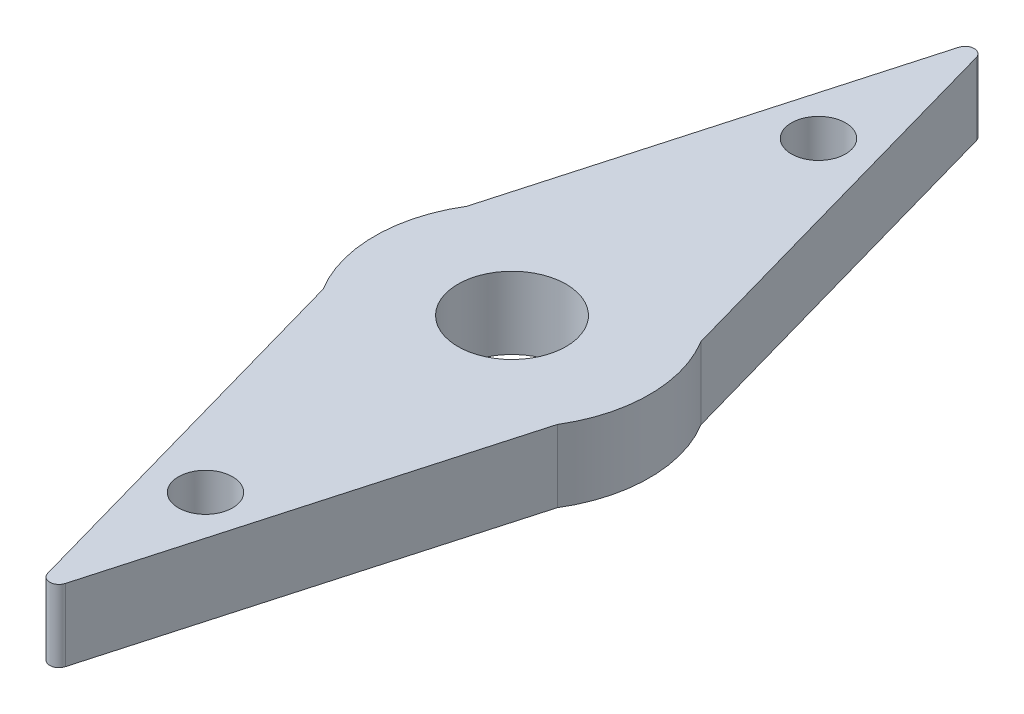
ISO-10303-21;
HEADER;
FILE_DESCRIPTION(('STEP AP214'),'2;1');
FILE_NAME('part.step','',(''),(''),'','','');
FILE_SCHEMA(('AUTOMOTIVE_DESIGN { 1 0 10303 214 1 1 1 1 }'));
ENDSEC;
DATA;
#1=APPLICATION_CONTEXT('core data for automotive mechanical design processes');
#2=APPLICATION_PROTOCOL_DEFINITION('international standard','automotive_design',2000,#1);
#3=PRODUCT_CONTEXT('',#1,'mechanical');
#4=PRODUCT('Part','Part','',(#3));
#5=PRODUCT_RELATED_PRODUCT_CATEGORY('part','',(#4));
#6=PRODUCT_DEFINITION_FORMATION('','',#4);
#7=PRODUCT_DEFINITION_CONTEXT('part definition',#1,'design');
#8=PRODUCT_DEFINITION('design','',#6,#7);
#9=PRODUCT_DEFINITION_SHAPE('','',#8);
#10=(LENGTH_UNIT() NAMED_UNIT(*) SI_UNIT(.MILLI.,.METRE.));
#11=(NAMED_UNIT(*) PLANE_ANGLE_UNIT() SI_UNIT($,.RADIAN.));
#12=(NAMED_UNIT(*) SI_UNIT($,.STERADIAN.) SOLID_ANGLE_UNIT());
#13=UNCERTAINTY_MEASURE_WITH_UNIT(LENGTH_MEASURE(1.E-05),#10,'distance_accuracy_value','');
#14=(GEOMETRIC_REPRESENTATION_CONTEXT(3) GLOBAL_UNCERTAINTY_ASSIGNED_CONTEXT((#13)) GLOBAL_UNIT_ASSIGNED_CONTEXT((#10,
#11,#12)) REPRESENTATION_CONTEXT('',''));
#15=CARTESIAN_POINT('',(0.,0.,0.));
#16=DIRECTION('',(0.,0.,1.));
#17=DIRECTION('',(1.,0.,0.));
#18=AXIS2_PLACEMENT_3D('',#15,#16,#17);
#19=CARTESIAN_POINT('',(0.,2.,0.));
#20=DIRECTION('',(0.,-1.,0.));
#21=DIRECTION('',(0.,0.,-1.));
#22=AXIS2_PLACEMENT_3D('',#19,#20,#21);
#23=CYLINDRICAL_SURFACE('',#22,3.81);
#24=CARTESIAN_POINT('',(0.,0.,0.));
#25=DIRECTION('',(0.,1.,0.));
#26=DIRECTION('',(0.,0.,1.));
#27=AXIS2_PLACEMENT_3D('',#24,#25,#26);
#28=CIRCLE('',#27,3.81);
#29=CARTESIAN_POINT('',(3.24784685471735,0.,1.99188122344245));
#30=VERTEX_POINT('',#29);
#31=CARTESIAN_POINT('',(3.24784685471735,0.,-1.99188122344245));
#32=VERTEX_POINT('',#31);
#33=EDGE_CURVE('E109',#30,#32,#28,.T.);
#34=ORIENTED_EDGE('',*,*,#33,.T.);
#35=DIRECTION('',(0.,1.,0.));
#36=VECTOR('',#35,1.);
#37=CARTESIAN_POINT('',(3.24784685471735,-13.2147960461804,-1.99188122344245));
#38=LINE('',#37,#36);
#39=CARTESIAN_POINT('',(3.24784685471735,2.,-1.99188122344245));
#40=VERTEX_POINT('',#39);
#41=EDGE_CURVE('E118',#32,#40,#38,.T.);
#42=ORIENTED_EDGE('',*,*,#41,.T.);
#43=CARTESIAN_POINT('',(0.,2.,0.));
#44=DIRECTION('',(0.,1.,0.));
#45=DIRECTION('',(0.,0.,1.));
#46=AXIS2_PLACEMENT_3D('',#43,#44,#45);
#47=CIRCLE('',#46,3.81);
#48=CARTESIAN_POINT('',(3.24784685471735,2.,1.99188122344245));
#49=VERTEX_POINT('',#48);
#50=EDGE_CURVE('E139',#49,#40,#47,.T.);
#51=ORIENTED_EDGE('',*,*,#50,.F.);
#52=DIRECTION('',(0.,1.,0.));
#53=VECTOR('',#52,1.);
#54=CARTESIAN_POINT('',(3.24784685471735,-13.2147960461804,1.99188122344245));
#55=LINE('',#54,#53);
#56=EDGE_CURVE('E135',#30,#49,#55,.T.);
#57=ORIENTED_EDGE('',*,*,#56,.F.);
#58=EDGE_LOOP('',(#34,#42,#51,#57));
#59=FACE_BOUND('',#58,.T.);
#60=ADVANCED_FACE('F36',(#59),#23,.T.);
#61=CARTESIAN_POINT('',(-3.24784685471735,2.,-1.99188122344245));
#62=VERTEX_POINT('',#61);
#63=CARTESIAN_POINT('',(-3.24784685471735,2.,1.99188122344245));
#64=VERTEX_POINT('',#63);
#65=EDGE_CURVE('E117',#62,#64,#47,.T.);
#66=ORIENTED_EDGE('',*,*,#65,.F.);
#67=DIRECTION('',(0.,1.,0.));
#68=VECTOR('',#67,1.);
#69=CARTESIAN_POINT('',(-3.24784685471735,-13.2147960461804,-1.99188122344245));
#70=LINE('',#69,#68);
#71=CARTESIAN_POINT('',(-3.24784685471735,0.,-1.99188122344245));
#72=VERTEX_POINT('',#71);
#73=EDGE_CURVE('E114',#72,#62,#70,.T.);
#74=ORIENTED_EDGE('',*,*,#73,.F.);
#75=CARTESIAN_POINT('',(-3.24784685471735,0.,1.99188122344245));
#76=VERTEX_POINT('',#75);
#77=EDGE_CURVE('E99',#72,#76,#28,.T.);
#78=ORIENTED_EDGE('',*,*,#77,.T.);
#79=DIRECTION('',(0.,1.,0.));
#80=VECTOR('',#79,1.);
#81=CARTESIAN_POINT('',(-3.24784685471735,-13.2147960461804,1.99188122344245));
#82=LINE('',#81,#80);
#83=EDGE_CURVE('E132',#76,#64,#82,.T.);
#84=ORIENTED_EDGE('',*,*,#83,.T.);
#85=EDGE_LOOP('',(#66,#74,#78,#84));
#86=FACE_BOUND('',#85,.T.);
#87=ADVANCED_FACE('F115',(#86),#23,.T.);
#88=CARTESIAN_POINT('',(0.,2.,0.));
#89=DIRECTION('',(0.,1.,0.));
#90=DIRECTION('',(0.,0.,1.));
#91=AXIS2_PLACEMENT_3D('',#88,#89,#90);
#92=PLANE('',#91);
#93=CARTESIAN_POINT('',(0.,2.,0.));
#94=DIRECTION('',(0.,-1.,0.));
#95=DIRECTION('',(0.,0.,-1.));
#96=AXIS2_PLACEMENT_3D('',#93,#94,#95);
#97=CIRCLE('',#96,1.5);
#98=CARTESIAN_POINT('',(0.,2.,-1.5));
#99=VERTEX_POINT('',#98);
#100=EDGE_CURVE('E225',#99,#99,#97,.T.);
#101=ORIENTED_EDGE('',*,*,#100,.T.);
#102=EDGE_LOOP('',(#101));
#103=FACE_BOUND('',#102,.T.);
#104=CARTESIAN_POINT('',(0.,2.,8.5));
#105=DIRECTION('',(0.,1.,0.));
#106=DIRECTION('',(0.,0.,-1.));
#107=AXIS2_PLACEMENT_3D('',#104,#105,#106);
#108=CIRCLE('',#107,0.75);
#109=CARTESIAN_POINT('',(0.,2.,7.75));
#110=VERTEX_POINT('',#109);
#111=EDGE_CURVE('E230',#110,#110,#108,.T.);
#112=ORIENTED_EDGE('',*,*,#111,.F.);
#113=EDGE_LOOP('',(#112));
#114=FACE_BOUND('',#113,.T.);
#115=CARTESIAN_POINT('',(0.,2.,-8.5));
#116=DIRECTION('',(0.,1.,0.));
#117=DIRECTION('',(0.,0.,1.));
#118=AXIS2_PLACEMENT_3D('',#115,#116,#117);
#119=CIRCLE('',#118,0.75);
#120=CARTESIAN_POINT('',(0.,2.,-7.75));
#121=VERTEX_POINT('',#120);
#122=EDGE_CURVE('E171',#121,#121,#119,.T.);
#123=ORIENTED_EDGE('',*,*,#122,.F.);
#124=EDGE_LOOP('',(#123));
#125=FACE_BOUND('',#124,.T.);
#126=DIRECTION('',(-0.271612552445606,0.,-0.962406681893878));
#127=VECTOR('',#126,1.);
#128=CARTESIAN_POINT('',(-3.52892342735868,2.,0.995940611721226));
#129=LINE('',#128,#127);
#130=CARTESIAN_POINT('',(-0.244451297201043,2.,12.6338339862955));
#131=VERTEX_POINT('',#130);
#132=EDGE_CURVE('E126',#131,#64,#129,.T.);
#133=ORIENTED_EDGE('',*,*,#132,.F.);
#134=CARTESIAN_POINT('',(0.,2.,12.5648443979743));
#135=DIRECTION('',(0.,1.,0.));
#136=DIRECTION('',(0.,0.,1.));
#137=AXIS2_PLACEMENT_3D('',#134,#135,#136);
#138=CIRCLE('',#137,0.254);
#139=CARTESIAN_POINT('',(0.244451297201043,2.,12.6338339862955));
#140=VERTEX_POINT('',#139);
#141=EDGE_CURVE('E148',#131,#140,#138,.T.);
#142=ORIENTED_EDGE('',*,*,#141,.T.);
#143=DIRECTION('',(-0.271612552445606,0.,0.962406681893878));
#144=VECTOR('',#143,1.);
#145=CARTESIAN_POINT('',(3.52892342735868,2.,0.995940611721226));
#146=LINE('',#145,#144);
#147=EDGE_CURVE('E122',#49,#140,#146,.T.);
#148=ORIENTED_EDGE('',*,*,#147,.F.);
#149=ORIENTED_EDGE('',*,*,#50,.T.);
#150=DIRECTION('',(-0.271612552445606,0.,-0.962406681893878));
#151=VECTOR('',#150,1.);
#152=CARTESIAN_POINT('',(3.52892342735868,2.,-0.995940611721226));
#153=LINE('',#152,#151);
#154=CARTESIAN_POINT('',(0.244451297201043,2.,-12.6338339862955));
#155=VERTEX_POINT('',#154);
#156=EDGE_CURVE('E161',#40,#155,#153,.T.);
#157=ORIENTED_EDGE('',*,*,#156,.T.);
#158=CARTESIAN_POINT('',(0.,2.,-12.5648443979743));
#159=DIRECTION('',(0.,1.,0.));
#160=DIRECTION('',(0.,0.,1.));
#161=AXIS2_PLACEMENT_3D('',#158,#159,#160);
#162=CIRCLE('',#161,0.254);
#163=CARTESIAN_POINT('',(-0.244451297201043,2.,-12.6338339862955));
#164=VERTEX_POINT('',#163);
#165=EDGE_CURVE('E146',#155,#164,#162,.T.);
#166=ORIENTED_EDGE('',*,*,#165,.T.);
#167=DIRECTION('',(-0.271612552445606,0.,0.962406681893878));
#168=VECTOR('',#167,1.);
#169=CARTESIAN_POINT('',(-3.52892342735868,2.,-0.995940611721226));
#170=LINE('',#169,#168);
#171=EDGE_CURVE('E119',#164,#62,#170,.T.);
#172=ORIENTED_EDGE('',*,*,#171,.T.);
#173=ORIENTED_EDGE('',*,*,#65,.T.);
#174=EDGE_LOOP('',(#133,#142,#148,#149,#157,#166,#172,#173));
#175=FACE_BOUND('',#174,.T.);
#176=ADVANCED_FACE('F165',(#103,#114,#125,#175),#92,.T.);
#177=CARTESIAN_POINT('',(0.,0.,0.));
#178=DIRECTION('',(0.,1.,0.));
#179=DIRECTION('',(0.,0.,1.));
#180=AXIS2_PLACEMENT_3D('',#177,#178,#179);
#181=PLANE('',#180);
#182=CARTESIAN_POINT('',(0.,0.,0.));
#183=DIRECTION('',(0.,-1.,0.));
#184=DIRECTION('',(0.,0.,-1.));
#185=AXIS2_PLACEMENT_3D('',#182,#183,#184);
#186=CIRCLE('',#185,1.5);
#187=CARTESIAN_POINT('',(0.,0.,-1.5));
#188=VERTEX_POINT('',#187);
#189=EDGE_CURVE('E228',#188,#188,#186,.T.);
#190=ORIENTED_EDGE('',*,*,#189,.F.);
#191=EDGE_LOOP('',(#190));
#192=FACE_BOUND('',#191,.T.);
#193=CARTESIAN_POINT('',(0.,0.,8.5));
#194=DIRECTION('',(0.,1.,0.));
#195=DIRECTION('',(0.,0.,1.));
#196=AXIS2_PLACEMENT_3D('',#193,#194,#195);
#197=CIRCLE('',#196,0.75);
#198=CARTESIAN_POINT('',(0.,0.,9.25));
#199=VERTEX_POINT('',#198);
#200=EDGE_CURVE('E235',#199,#199,#197,.F.);
#201=ORIENTED_EDGE('',*,*,#200,.F.);
#202=EDGE_LOOP('',(#201));
#203=FACE_BOUND('',#202,.T.);
#204=CARTESIAN_POINT('',(0.,0.,-8.5));
#205=DIRECTION('',(0.,1.,0.));
#206=DIRECTION('',(0.,0.,1.));
#207=AXIS2_PLACEMENT_3D('',#204,#205,#206);
#208=CIRCLE('',#207,0.75);
#209=CARTESIAN_POINT('',(0.,0.,-7.75));
#210=VERTEX_POINT('',#209);
#211=EDGE_CURVE('E167',#210,#210,#208,.F.);
#212=ORIENTED_EDGE('',*,*,#211,.F.);
#213=EDGE_LOOP('',(#212));
#214=FACE_BOUND('',#213,.T.);
#215=DIRECTION('',(0.271612552445605,0.,-0.962406681893878));
#216=VECTOR('',#215,1.);
#217=CARTESIAN_POINT('',(3.52892342735868,0.,0.995940611721226));
#218=LINE('',#217,#216);
#219=CARTESIAN_POINT('',(0.244451297201044,0.,12.6338339862955));
#220=VERTEX_POINT('',#219);
#221=EDGE_CURVE('E110',#220,#30,#218,.T.);
#222=ORIENTED_EDGE('',*,*,#221,.F.);
#223=CARTESIAN_POINT('',(0.,0.,12.5648443979743));
#224=DIRECTION('',(0.,1.,0.));
#225=DIRECTION('',(0.,0.,1.));
#226=AXIS2_PLACEMENT_3D('',#223,#224,#225);
#227=CIRCLE('',#226,0.254);
#228=CARTESIAN_POINT('',(-0.244451297201044,0.,12.6338339862955));
#229=VERTEX_POINT('',#228);
#230=EDGE_CURVE('E153',#220,#229,#227,.F.);
#231=ORIENTED_EDGE('',*,*,#230,.T.);
#232=DIRECTION('',(0.271612552445605,0.,0.962406681893878));
#233=VECTOR('',#232,1.);
#234=CARTESIAN_POINT('',(-3.52892342735868,0.,0.995940611721226));
#235=LINE('',#234,#233);
#236=EDGE_CURVE('E105',#76,#229,#235,.T.);
#237=ORIENTED_EDGE('',*,*,#236,.F.);
#238=ORIENTED_EDGE('',*,*,#77,.F.);
#239=DIRECTION('',(0.271612552445605,0.,-0.962406681893878));
#240=VECTOR('',#239,1.);
#241=CARTESIAN_POINT('',(-3.52892342735868,0.,-0.995940611721226));
#242=LINE('',#241,#240);
#243=CARTESIAN_POINT('',(-0.244451297201044,0.,-12.6338339862955));
#244=VERTEX_POINT('',#243);
#245=EDGE_CURVE('E103',#72,#244,#242,.T.);
#246=ORIENTED_EDGE('',*,*,#245,.T.);
#247=CARTESIAN_POINT('',(0.,0.,-12.5648443979743));
#248=DIRECTION('',(0.,1.,0.));
#249=DIRECTION('',(0.,0.,1.));
#250=AXIS2_PLACEMENT_3D('',#247,#248,#249);
#251=CIRCLE('',#250,0.254);
#252=CARTESIAN_POINT('',(0.244451297201044,0.,-12.6338339862955));
#253=VERTEX_POINT('',#252);
#254=EDGE_CURVE('E51',#244,#253,#251,.F.);
#255=ORIENTED_EDGE('',*,*,#254,.T.);
#256=DIRECTION('',(0.271612552445605,0.,0.962406681893878));
#257=VECTOR('',#256,1.);
#258=CARTESIAN_POINT('',(3.52892342735868,0.,-0.995940611721226));
#259=LINE('',#258,#257);
#260=EDGE_CURVE('E123',#253,#32,#259,.T.);
#261=ORIENTED_EDGE('',*,*,#260,.T.);
#262=ORIENTED_EDGE('',*,*,#33,.F.);
#263=EDGE_LOOP('',(#222,#231,#237,#238,#246,#255,#261,#262));
#264=FACE_BOUND('',#263,.T.);
#265=ADVANCED_FACE('F102',(#192,#203,#214,#264),#181,.F.);
#266=CARTESIAN_POINT('',(-3.52892342735868,-13.2147960461804,0.995940611721226));
#267=DIRECTION('',(0.962406681893878,0.,-0.271612552445605));
#268=DIRECTION('',(-0.271612552445605,0.,-0.962406681893878));
#269=AXIS2_PLACEMENT_3D('',#266,#267,#268);
#270=PLANE('',#269);
#271=ORIENTED_EDGE('',*,*,#236,.T.);
#272=DIRECTION('',(0.,1.,0.));
#273=VECTOR('',#272,1.);
#274=CARTESIAN_POINT('',(-0.244451297201044,-13.2147960461804,12.6338339862955));
#275=LINE('',#274,#273);
#276=EDGE_CURVE('E141',#229,#131,#275,.T.);
#277=ORIENTED_EDGE('',*,*,#276,.T.);
#278=ORIENTED_EDGE('',*,*,#132,.T.);
#279=ORIENTED_EDGE('',*,*,#83,.F.);
#280=EDGE_LOOP('',(#271,#277,#278,#279));
#281=FACE_BOUND('',#280,.T.);
#282=ADVANCED_FACE('F183',(#281),#270,.F.);
#283=CARTESIAN_POINT('',(3.52892342735868,-13.2147960461804,0.995940611721226));
#284=DIRECTION('',(-0.962406681893878,0.,-0.271612552445605));
#285=DIRECTION('',(-0.271612552445605,0.,0.962406681893878));
#286=AXIS2_PLACEMENT_3D('',#283,#284,#285);
#287=PLANE('',#286);
#288=ORIENTED_EDGE('',*,*,#147,.T.);
#289=DIRECTION('',(0.,1.,0.));
#290=VECTOR('',#289,1.);
#291=CARTESIAN_POINT('',(0.244451297201044,-13.2147960461804,12.6338339862955));
#292=LINE('',#291,#290);
#293=EDGE_CURVE('E150',#140,#220,#292,.F.);
#294=ORIENTED_EDGE('',*,*,#293,.T.);
#295=ORIENTED_EDGE('',*,*,#221,.T.);
#296=ORIENTED_EDGE('',*,*,#56,.T.);
#297=EDGE_LOOP('',(#288,#294,#295,#296));
#298=FACE_BOUND('',#297,.T.);
#299=ADVANCED_FACE('F205',(#298),#287,.F.);
#300=CARTESIAN_POINT('',(3.52892342735868,-13.2147960461804,-0.995940611721226));
#301=DIRECTION('',(0.962406681893878,0.,-0.271612552445605));
#302=DIRECTION('',(-0.271612552445605,0.,-0.962406681893878));
#303=AXIS2_PLACEMENT_3D('',#300,#301,#302);
#304=PLANE('',#303);
#305=ORIENTED_EDGE('',*,*,#260,.F.);
#306=DIRECTION('',(0.,1.,0.));
#307=VECTOR('',#306,1.);
#308=CARTESIAN_POINT('',(0.244451297201044,-13.2147960461804,-12.6338339862955));
#309=LINE('',#308,#307);
#310=EDGE_CURVE('E44',#253,#155,#309,.T.);
#311=ORIENTED_EDGE('',*,*,#310,.T.);
#312=ORIENTED_EDGE('',*,*,#156,.F.);
#313=ORIENTED_EDGE('',*,*,#41,.F.);
#314=EDGE_LOOP('',(#305,#311,#312,#313));
#315=FACE_BOUND('',#314,.T.);
#316=ADVANCED_FACE('F159',(#315),#304,.T.);
#317=CARTESIAN_POINT('',(-3.52892342735868,-13.2147960461804,-0.995940611721226));
#318=DIRECTION('',(-0.962406681893878,0.,-0.271612552445605));
#319=DIRECTION('',(-0.271612552445605,0.,0.962406681893878));
#320=AXIS2_PLACEMENT_3D('',#317,#318,#319);
#321=PLANE('',#320);
#322=ORIENTED_EDGE('',*,*,#171,.F.);
#323=DIRECTION('',(0.,1.,0.));
#324=VECTOR('',#323,1.);
#325=CARTESIAN_POINT('',(-0.244451297201044,-13.2147960461804,-12.6338339862955));
#326=LINE('',#325,#324);
#327=EDGE_CURVE('E11',#164,#244,#326,.F.);
#328=ORIENTED_EDGE('',*,*,#327,.T.);
#329=ORIENTED_EDGE('',*,*,#245,.F.);
#330=ORIENTED_EDGE('',*,*,#73,.T.);
#331=EDGE_LOOP('',(#322,#328,#329,#330));
#332=FACE_BOUND('',#331,.T.);
#333=ADVANCED_FACE('F121',(#332),#321,.T.);
#334=CARTESIAN_POINT('',(0.,-13.2147960461804,12.5648443979743));
#335=DIRECTION('',(0.,1.,0.));
#336=DIRECTION('',(0.,0.,1.));
#337=AXIS2_PLACEMENT_3D('',#334,#335,#336);
#338=CYLINDRICAL_SURFACE('',#337,0.254);
#339=ORIENTED_EDGE('',*,*,#230,.F.);
#340=ORIENTED_EDGE('',*,*,#293,.F.);
#341=ORIENTED_EDGE('',*,*,#141,.F.);
#342=ORIENTED_EDGE('',*,*,#276,.F.);
#343=EDGE_LOOP('',(#339,#340,#341,#342));
#344=FACE_BOUND('',#343,.T.);
#345=ADVANCED_FACE('F181',(#344),#338,.T.);
#346=CARTESIAN_POINT('',(0.,-13.2147960461804,-12.5648443979743));
#347=DIRECTION('',(0.,1.,0.));
#348=DIRECTION('',(0.,0.,1.));
#349=AXIS2_PLACEMENT_3D('',#346,#347,#348);
#350=CYLINDRICAL_SURFACE('',#349,0.254);
#351=ORIENTED_EDGE('',*,*,#254,.F.);
#352=ORIENTED_EDGE('',*,*,#327,.F.);
#353=ORIENTED_EDGE('',*,*,#165,.F.);
#354=ORIENTED_EDGE('',*,*,#310,.F.);
#355=EDGE_LOOP('',(#351,#352,#353,#354));
#356=FACE_BOUND('',#355,.T.);
#357=ADVANCED_FACE('F38',(#356),#350,.T.);
#358=CARTESIAN_POINT('',(0.,-2.12132034355964,-8.5));
#359=DIRECTION('',(0.,1.,0.));
#360=DIRECTION('',(0.,0.,1.));
#361=AXIS2_PLACEMENT_3D('',#358,#359,#360);
#362=CYLINDRICAL_SURFACE('',#361,0.75);
#363=ORIENTED_EDGE('',*,*,#211,.T.);
#364=EDGE_LOOP('',(#363));
#365=FACE_BOUND('',#364,.T.);
#366=ORIENTED_EDGE('',*,*,#122,.T.);
#367=EDGE_LOOP('',(#366));
#368=FACE_BOUND('',#367,.T.);
#369=ADVANCED_FACE('F185',(#365,#368),#362,.F.);
#370=CARTESIAN_POINT('',(0.,-2.12132034355964,8.5));
#371=DIRECTION('',(0.,1.,0.));
#372=DIRECTION('',(0.,0.,1.));
#373=AXIS2_PLACEMENT_3D('',#370,#371,#372);
#374=CYLINDRICAL_SURFACE('',#373,0.75);
#375=ORIENTED_EDGE('',*,*,#200,.T.);
#376=EDGE_LOOP('',(#375));
#377=FACE_BOUND('',#376,.T.);
#378=ORIENTED_EDGE('',*,*,#111,.T.);
#379=EDGE_LOOP('',(#378));
#380=FACE_BOUND('',#379,.T.);
#381=ADVANCED_FACE('F190',(#377,#380),#374,.F.);
#382=CARTESIAN_POINT('',(0.,2.,0.));
#383=DIRECTION('',(0.,-1.,0.));
#384=DIRECTION('',(0.,0.,-1.));
#385=AXIS2_PLACEMENT_3D('',#382,#383,#384);
#386=CYLINDRICAL_SURFACE('',#385,1.5);
#387=ORIENTED_EDGE('',*,*,#100,.F.);
#388=EDGE_LOOP('',(#387));
#389=FACE_BOUND('',#388,.T.);
#390=ORIENTED_EDGE('',*,*,#189,.T.);
#391=EDGE_LOOP('',(#390));
#392=FACE_BOUND('',#391,.T.);
#393=ADVANCED_FACE('F216',(#389,#392),#386,.F.);
#394=CLOSED_SHELL('',(#60,#87,#176,#265,#282,#299,#316,#333,#345,#357,#369,#381,#393));
#395=MANIFOLD_SOLID_BREP('B2',#394);
#396=ADVANCED_BREP_SHAPE_REPRESENTATION('',(#18,#395),#14);
#397=SHAPE_DEFINITION_REPRESENTATION(#9,#396);
ENDSEC;
END-ISO-10303-21;
